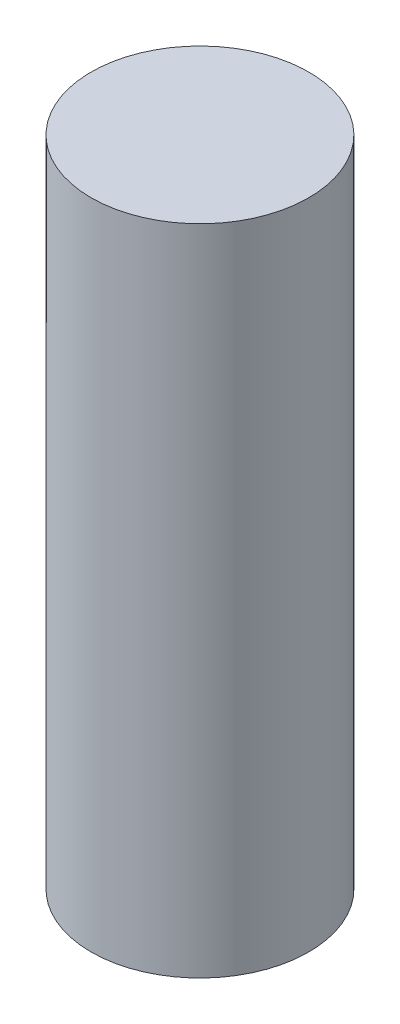
ISO-10303-21;
HEADER;
FILE_DESCRIPTION(('STEP AP214'),'2;1');
FILE_NAME('part.step','',(''),(''),'','','');
FILE_SCHEMA(('AUTOMOTIVE_DESIGN { 1 0 10303 214 1 1 1 1 }'));
ENDSEC;
DATA;
#1=APPLICATION_CONTEXT('core data for automotive mechanical design processes');
#2=APPLICATION_PROTOCOL_DEFINITION('international standard','automotive_design',2000,#1);
#3=PRODUCT_CONTEXT('',#1,'mechanical');
#4=PRODUCT('Part','Part','',(#3));
#5=PRODUCT_RELATED_PRODUCT_CATEGORY('part','',(#4));
#6=PRODUCT_DEFINITION_FORMATION('','',#4);
#7=PRODUCT_DEFINITION_CONTEXT('part definition',#1,'design');
#8=PRODUCT_DEFINITION('design','',#6,#7);
#9=PRODUCT_DEFINITION_SHAPE('','',#8);
#10=(LENGTH_UNIT() NAMED_UNIT(*) SI_UNIT(.MILLI.,.METRE.));
#11=(NAMED_UNIT(*) PLANE_ANGLE_UNIT() SI_UNIT($,.RADIAN.));
#12=(NAMED_UNIT(*) SI_UNIT($,.STERADIAN.) SOLID_ANGLE_UNIT());
#13=UNCERTAINTY_MEASURE_WITH_UNIT(LENGTH_MEASURE(1.E-05),#10,'distance_accuracy_value','');
#14=(GEOMETRIC_REPRESENTATION_CONTEXT(3) GLOBAL_UNCERTAINTY_ASSIGNED_CONTEXT((#13)) GLOBAL_UNIT_ASSIGNED_CONTEXT((#10,
#11,#12)) REPRESENTATION_CONTEXT('',''));
#15=CARTESIAN_POINT('',(0.,0.,0.));
#16=DIRECTION('',(0.,0.,1.));
#17=DIRECTION('',(1.,0.,0.));
#18=AXIS2_PLACEMENT_3D('',#15,#16,#17);
#19=CARTESIAN_POINT('',(0.,30.,0.));
#20=DIRECTION('',(0.,-1.,0.));
#21=DIRECTION('',(0.,0.,-1.));
#22=AXIS2_PLACEMENT_3D('',#19,#20,#21);
#23=CYLINDRICAL_SURFACE('',#22,5.);
#24=CARTESIAN_POINT('',(0.,30.,0.));
#25=DIRECTION('',(0.,1.,0.));
#26=DIRECTION('',(0.,0.,1.));
#27=AXIS2_PLACEMENT_3D('',#24,#25,#26);
#28=CIRCLE('',#27,5.);
#29=CARTESIAN_POINT('',(0.,30.,5.));
#30=VERTEX_POINT('',#29);
#31=EDGE_CURVE('E10',#30,#30,#28,.T.);
#32=ORIENTED_EDGE('',*,*,#31,.F.);
#33=EDGE_LOOP('',(#32));
#34=FACE_BOUND('',#33,.T.);
#35=CARTESIAN_POINT('',(0.,0.,0.));
#36=DIRECTION('',(0.,1.,0.));
#37=DIRECTION('',(0.,0.,1.));
#38=AXIS2_PLACEMENT_3D('',#35,#36,#37);
#39=CIRCLE('',#38,5.);
#40=CARTESIAN_POINT('',(0.,0.,5.));
#41=VERTEX_POINT('',#40);
#42=EDGE_CURVE('E33',#41,#41,#39,.T.);
#43=ORIENTED_EDGE('',*,*,#42,.T.);
#44=EDGE_LOOP('',(#43));
#45=FACE_BOUND('',#44,.T.);
#46=ADVANCED_FACE('F30',(#34,#45),#23,.T.);
#47=CARTESIAN_POINT('',(0.,30.,0.));
#48=DIRECTION('',(0.,1.,0.));
#49=DIRECTION('',(0.,0.,1.));
#50=AXIS2_PLACEMENT_3D('',#47,#48,#49);
#51=PLANE('',#50);
#52=ORIENTED_EDGE('',*,*,#31,.T.);
#53=EDGE_LOOP('',(#52));
#54=FACE_BOUND('',#53,.T.);
#55=ADVANCED_FACE('F45',(#54),#51,.T.);
#56=CARTESIAN_POINT('',(0.,0.,0.));
#57=DIRECTION('',(0.,1.,0.));
#58=DIRECTION('',(0.,0.,1.));
#59=AXIS2_PLACEMENT_3D('',#56,#57,#58);
#60=PLANE('',#59);
#61=ORIENTED_EDGE('',*,*,#42,.F.);
#62=EDGE_LOOP('',(#61));
#63=FACE_BOUND('',#62,.T.);
#64=ADVANCED_FACE('F43',(#63),#60,.F.);
#65=CLOSED_SHELL('',(#46,#55,#64));
#66=MANIFOLD_SOLID_BREP('B2',#65);
#67=ADVANCED_BREP_SHAPE_REPRESENTATION('',(#18,#66),#14);
#68=SHAPE_DEFINITION_REPRESENTATION(#9,#67);
ENDSEC;
END-ISO-10303-21;
